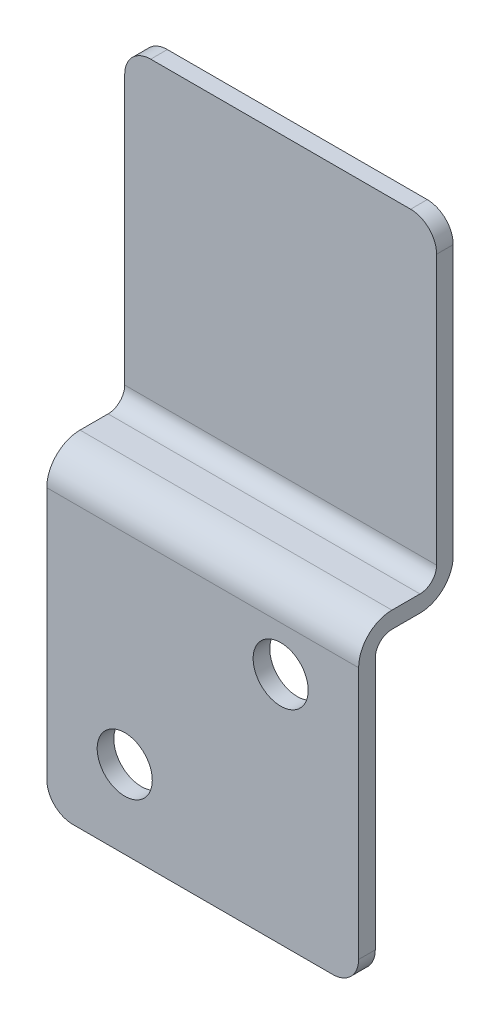
ISO-10303-21;
HEADER;
FILE_DESCRIPTION(('STEP AP214'),'2;1');
FILE_NAME('part.step','',(''),(''),'','','');
FILE_SCHEMA(('AUTOMOTIVE_DESIGN { 1 0 10303 214 1 1 1 1 }'));
ENDSEC;
DATA;
#1=APPLICATION_CONTEXT('core data for automotive mechanical design processes');
#2=APPLICATION_PROTOCOL_DEFINITION('international standard','automotive_design',2000,#1);
#3=PRODUCT_CONTEXT('',#1,'mechanical');
#4=PRODUCT('Part','Part','',(#3));
#5=PRODUCT_RELATED_PRODUCT_CATEGORY('part','',(#4));
#6=PRODUCT_DEFINITION_FORMATION('','',#4);
#7=PRODUCT_DEFINITION_CONTEXT('part definition',#1,'design');
#8=PRODUCT_DEFINITION('design','',#6,#7);
#9=PRODUCT_DEFINITION_SHAPE('','',#8);
#10=(LENGTH_UNIT() NAMED_UNIT(*) SI_UNIT(.MILLI.,.METRE.));
#11=(NAMED_UNIT(*) PLANE_ANGLE_UNIT() SI_UNIT($,.RADIAN.));
#12=(NAMED_UNIT(*) SI_UNIT($,.STERADIAN.) SOLID_ANGLE_UNIT());
#13=UNCERTAINTY_MEASURE_WITH_UNIT(LENGTH_MEASURE(1.E-05),#10,'distance_accuracy_value','');
#14=(GEOMETRIC_REPRESENTATION_CONTEXT(3) GLOBAL_UNCERTAINTY_ASSIGNED_CONTEXT((#13)) GLOBAL_UNIT_ASSIGNED_CONTEXT((#10,
#11,#12)) REPRESENTATION_CONTEXT('',''));
#15=CARTESIAN_POINT('',(0.,0.,0.));
#16=DIRECTION('',(0.,0.,1.));
#17=DIRECTION('',(1.,0.,0.));
#18=AXIS2_PLACEMENT_3D('',#15,#16,#17);
#19=CARTESIAN_POINT('',(38.1,0.,0.));
#20=DIRECTION('',(0.,-1.,0.));
#21=DIRECTION('',(0.,0.,-1.));
#22=AXIS2_PLACEMENT_3D('',#19,#20,#21);
#23=PLANE('',#22);
#24=DIRECTION('',(-1.,0.,0.));
#25=VECTOR('',#24,1.);
#26=CARTESIAN_POINT('',(38.1,0.,-2.032));
#27=LINE('',#26,#25);
#28=CARTESIAN_POINT('',(34.925,0.,-2.032));
#29=VERTEX_POINT('',#28);
#30=CARTESIAN_POINT('',(3.17500000000001,0.,-2.032));
#31=VERTEX_POINT('',#30);
#32=EDGE_CURVE('E189',#29,#31,#27,.T.);
#33=ORIENTED_EDGE('',*,*,#32,.T.);
#34=DIRECTION('',(0.,0.,1.));
#35=VECTOR('',#34,1.);
#36=CARTESIAN_POINT('',(3.175,0.,0.));
#37=LINE('',#36,#35);
#38=CARTESIAN_POINT('',(3.17500000000001,0.,0.));
#39=VERTEX_POINT('',#38);
#40=EDGE_CURVE('E249',#31,#39,#37,.T.);
#41=ORIENTED_EDGE('',*,*,#40,.T.);
#42=DIRECTION('',(-1.,0.,0.));
#43=VECTOR('',#42,1.);
#44=CARTESIAN_POINT('',(38.1,0.,0.));
#45=LINE('',#44,#43);
#46=CARTESIAN_POINT('',(34.925,0.,0.));
#47=VERTEX_POINT('',#46);
#48=EDGE_CURVE('E174',#47,#39,#45,.T.);
#49=ORIENTED_EDGE('',*,*,#48,.F.);
#50=DIRECTION('',(0.,0.,1.));
#51=VECTOR('',#50,1.);
#52=CARTESIAN_POINT('',(34.925,0.,0.));
#53=LINE('',#52,#51);
#54=EDGE_CURVE('E247',#47,#29,#53,.F.);
#55=ORIENTED_EDGE('',*,*,#54,.T.);
#56=EDGE_LOOP('',(#33,#41,#49,#55));
#57=FACE_BOUND('',#56,.T.);
#58=ADVANCED_FACE('F34',(#57),#23,.F.);
#59=CARTESIAN_POINT('',(38.1,0.,0.));
#60=DIRECTION('',(0.,0.,-1.));
#61=DIRECTION('',(0.,1.,0.));
#62=AXIS2_PLACEMENT_3D('',#59,#60,#61);
#63=PLANE('',#62);
#64=ORIENTED_EDGE('',*,*,#48,.T.);
#65=CARTESIAN_POINT('',(3.175,-3.175,0.));
#66=DIRECTION('',(0.,0.,-1.));
#67=DIRECTION('',(0.,1.,0.));
#68=AXIS2_PLACEMENT_3D('',#65,#66,#67);
#69=CIRCLE('',#68,3.175);
#70=CARTESIAN_POINT('',(0.,-3.175,0.));
#71=VERTEX_POINT('',#70);
#72=EDGE_CURVE('E253',#39,#71,#69,.F.);
#73=ORIENTED_EDGE('',*,*,#72,.T.);
#74=DIRECTION('',(0.,-1.,0.));
#75=VECTOR('',#74,1.);
#76=CARTESIAN_POINT('',(0.,0.,0.));
#77=LINE('',#76,#75);
#78=CARTESIAN_POINT('',(0.,-36.068,0.));
#79=VERTEX_POINT('',#78);
#80=EDGE_CURVE('E264',#71,#79,#77,.T.);
#81=ORIENTED_EDGE('',*,*,#80,.T.);
#82=DIRECTION('',(-1.,0.,0.));
#83=VECTOR('',#82,1.);
#84=CARTESIAN_POINT('',(38.1,-36.068,0.));
#85=LINE('',#84,#83);
#86=CARTESIAN_POINT('',(38.1,-36.068,0.));
#87=VERTEX_POINT('',#86);
#88=EDGE_CURVE('E164',#79,#87,#85,.F.);
#89=ORIENTED_EDGE('',*,*,#88,.T.);
#90=DIRECTION('',(0.,-1.,0.));
#91=VECTOR('',#90,1.);
#92=CARTESIAN_POINT('',(38.1,0.,0.));
#93=LINE('',#92,#91);
#94=CARTESIAN_POINT('',(38.1,-3.175,0.));
#95=VERTEX_POINT('',#94);
#96=EDGE_CURVE('E183',#95,#87,#93,.T.);
#97=ORIENTED_EDGE('',*,*,#96,.F.);
#98=CARTESIAN_POINT('',(34.925,-3.175,0.));
#99=DIRECTION('',(0.,0.,-1.));
#100=DIRECTION('',(0.,1.,0.));
#101=AXIS2_PLACEMENT_3D('',#98,#99,#100);
#102=CIRCLE('',#101,3.175);
#103=EDGE_CURVE('E59',#95,#47,#102,.F.);
#104=ORIENTED_EDGE('',*,*,#103,.T.);
#105=EDGE_LOOP('',(#64,#73,#81,#89,#97,#104));
#106=FACE_BOUND('',#105,.T.);
#107=ADVANCED_FACE('F336',(#106),#63,.F.);
#108=CARTESIAN_POINT('',(38.1,-38.1,0.));
#109=DIRECTION('',(0.,-1.,0.));
#110=DIRECTION('',(0.,0.,-1.));
#111=AXIS2_PLACEMENT_3D('',#108,#109,#110);
#112=PLANE('',#111);
#113=DIRECTION('',(0.,0.,1.));
#114=VECTOR('',#113,1.);
#115=CARTESIAN_POINT('',(0.,-38.1,0.));
#116=LINE('',#115,#114);
#117=CARTESIAN_POINT('',(0.,-38.1,2.032));
#118=VERTEX_POINT('',#117);
#119=CARTESIAN_POINT('',(0.,-38.1,5.461));
#120=VERTEX_POINT('',#119);
#121=EDGE_CURVE('E285',#118,#120,#116,.T.);
#122=ORIENTED_EDGE('',*,*,#121,.T.);
#123=DIRECTION('',(-1.,0.,0.));
#124=VECTOR('',#123,1.);
#125=CARTESIAN_POINT('',(38.1,-38.1,5.461));
#126=LINE('',#125,#124);
#127=CARTESIAN_POINT('',(38.1,-38.1,5.461));
#128=VERTEX_POINT('',#127);
#129=EDGE_CURVE('E219',#120,#128,#126,.F.);
#130=ORIENTED_EDGE('',*,*,#129,.T.);
#131=DIRECTION('',(0.,0.,1.));
#132=VECTOR('',#131,1.);
#133=CARTESIAN_POINT('',(38.1,-38.1,0.));
#134=LINE('',#133,#132);
#135=CARTESIAN_POINT('',(38.1,-38.1,2.032));
#136=VERTEX_POINT('',#135);
#137=EDGE_CURVE('E274',#136,#128,#134,.T.);
#138=ORIENTED_EDGE('',*,*,#137,.F.);
#139=DIRECTION('',(-1.,0.,0.));
#140=VECTOR('',#139,1.);
#141=CARTESIAN_POINT('',(0.,-38.1,2.032));
#142=LINE('',#141,#140);
#143=EDGE_CURVE('E202',#136,#118,#142,.T.);
#144=ORIENTED_EDGE('',*,*,#143,.T.);
#145=EDGE_LOOP('',(#122,#130,#138,#144));
#146=FACE_BOUND('',#145,.T.);
#147=ADVANCED_FACE('F318',(#146),#112,.F.);
#148=CARTESIAN_POINT('',(38.1,-38.1,9.525));
#149=DIRECTION('',(0.,0.,-1.));
#150=DIRECTION('',(0.,1.,0.));
#151=AXIS2_PLACEMENT_3D('',#148,#149,#150);
#152=PLANE('',#151);
#153=CARTESIAN_POINT('',(9.525,-66.675,9.52500000000001));
#154=DIRECTION('',(0.,0.,1.));
#155=DIRECTION('',(1.,0.,0.));
#156=AXIS2_PLACEMENT_3D('',#153,#154,#155);
#157=CIRCLE('',#156,3.3655);
#158=CARTESIAN_POINT('',(12.8905,-66.675,9.52500000000001));
#159=VERTEX_POINT('',#158);
#160=EDGE_CURVE('E260',#159,#159,#157,.T.);
#161=ORIENTED_EDGE('',*,*,#160,.F.);
#162=EDGE_LOOP('',(#161));
#163=FACE_BOUND('',#162,.T.);
#164=CARTESIAN_POINT('',(28.575,-47.625,9.52500000000001));
#165=DIRECTION('',(0.,0.,1.));
#166=DIRECTION('',(1.,0.,0.));
#167=AXIS2_PLACEMENT_3D('',#164,#165,#166);
#168=CIRCLE('',#167,3.36549999999999);
#169=CARTESIAN_POINT('',(31.9405,-47.625,9.52500000000001));
#170=VERTEX_POINT('',#169);
#171=EDGE_CURVE('E266',#170,#170,#168,.T.);
#172=ORIENTED_EDGE('',*,*,#171,.F.);
#173=EDGE_LOOP('',(#172));
#174=FACE_BOUND('',#173,.T.);
#175=DIRECTION('',(0.,-1.,0.));
#176=VECTOR('',#175,1.);
#177=CARTESIAN_POINT('',(0.,-38.1,9.525));
#178=LINE('',#177,#176);
#179=CARTESIAN_POINT('',(0.,-42.164,9.525));
#180=VERTEX_POINT('',#179);
#181=CARTESIAN_POINT('',(0.,-73.025,9.52499999999999));
#182=VERTEX_POINT('',#181);
#183=EDGE_CURVE('E185',#180,#182,#178,.T.);
#184=ORIENTED_EDGE('',*,*,#183,.T.);
#185=CARTESIAN_POINT('',(3.175,-73.025,9.52499999999999));
#186=DIRECTION('',(0.,0.,-1.));
#187=DIRECTION('',(0.,1.,0.));
#188=AXIS2_PLACEMENT_3D('',#185,#186,#187);
#189=CIRCLE('',#188,3.175);
#190=CARTESIAN_POINT('',(3.17500000000001,-76.2,9.52499999999999));
#191=VERTEX_POINT('',#190);
#192=EDGE_CURVE('E245',#182,#191,#189,.F.);
#193=ORIENTED_EDGE('',*,*,#192,.T.);
#194=DIRECTION('',(-1.,0.,0.));
#195=VECTOR('',#194,1.);
#196=CARTESIAN_POINT('',(38.1,-76.2,9.52499999999999));
#197=LINE('',#196,#195);
#198=CARTESIAN_POINT('',(34.925,-76.2,9.52499999999999));
#199=VERTEX_POINT('',#198);
#200=EDGE_CURVE('E196',#199,#191,#197,.T.);
#201=ORIENTED_EDGE('',*,*,#200,.F.);
#202=CARTESIAN_POINT('',(34.925,-73.025,9.52499999999999));
#203=DIRECTION('',(0.,0.,-1.));
#204=DIRECTION('',(0.,1.,0.));
#205=AXIS2_PLACEMENT_3D('',#202,#203,#204);
#206=CIRCLE('',#205,3.175);
#207=CARTESIAN_POINT('',(38.1,-73.025,9.52499999999999));
#208=VERTEX_POINT('',#207);
#209=EDGE_CURVE('E243',#199,#208,#206,.F.);
#210=ORIENTED_EDGE('',*,*,#209,.T.);
#211=DIRECTION('',(0.,-1.,0.));
#212=VECTOR('',#211,1.);
#213=CARTESIAN_POINT('',(38.1,-38.1,9.525));
#214=LINE('',#213,#212);
#215=CARTESIAN_POINT('',(38.1,-42.164,9.525));
#216=VERTEX_POINT('',#215);
#217=EDGE_CURVE('E277',#216,#208,#214,.T.);
#218=ORIENTED_EDGE('',*,*,#217,.F.);
#219=DIRECTION('',(-1.,0.,0.));
#220=VECTOR('',#219,1.);
#221=CARTESIAN_POINT('',(38.1,-42.164,9.525));
#222=LINE('',#221,#220);
#223=EDGE_CURVE('E213',#216,#180,#222,.T.);
#224=ORIENTED_EDGE('',*,*,#223,.T.);
#225=EDGE_LOOP('',(#184,#193,#201,#210,#218,#224));
#226=FACE_BOUND('',#225,.T.);
#227=ADVANCED_FACE('F291',(#163,#174,#226),#152,.F.);
#228=CARTESIAN_POINT('',(38.1,-76.2,9.52499999999999));
#229=DIRECTION('',(0.,1.,0.));
#230=DIRECTION('',(0.,0.,1.));
#231=AXIS2_PLACEMENT_3D('',#228,#229,#230);
#232=PLANE('',#231);
#233=ORIENTED_EDGE('',*,*,#200,.T.);
#234=DIRECTION('',(0.,0.,-1.));
#235=VECTOR('',#234,1.);
#236=CARTESIAN_POINT('',(3.175,-76.2,7.49299999999999));
#237=LINE('',#236,#235);
#238=CARTESIAN_POINT('',(3.17500000000001,-76.2,7.49299999999999));
#239=VERTEX_POINT('',#238);
#240=EDGE_CURVE('E232',#191,#239,#237,.T.);
#241=ORIENTED_EDGE('',*,*,#240,.T.);
#242=DIRECTION('',(-1.,0.,0.));
#243=VECTOR('',#242,1.);
#244=CARTESIAN_POINT('',(38.1,-76.2,7.49299999999999));
#245=LINE('',#244,#243);
#246=CARTESIAN_POINT('',(34.925,-76.2,7.49299999999999));
#247=VERTEX_POINT('',#246);
#248=EDGE_CURVE('E192',#247,#239,#245,.T.);
#249=ORIENTED_EDGE('',*,*,#248,.F.);
#250=DIRECTION('',(0.,0.,-1.));
#251=VECTOR('',#250,1.);
#252=CARTESIAN_POINT('',(34.925,-76.2,9.52499999999999));
#253=LINE('',#252,#251);
#254=EDGE_CURVE('E230',#247,#199,#253,.F.);
#255=ORIENTED_EDGE('',*,*,#254,.T.);
#256=EDGE_LOOP('',(#233,#241,#249,#255));
#257=FACE_BOUND('',#256,.T.);
#258=ADVANCED_FACE('F301',(#257),#232,.F.);
#259=CARTESIAN_POINT('',(38.1,-40.132,7.493));
#260=DIRECTION('',(0.,0.,1.));
#261=DIRECTION('',(0.,-1.,0.));
#262=AXIS2_PLACEMENT_3D('',#259,#260,#261);
#263=PLANE('',#262);
#264=CARTESIAN_POINT('',(9.525,-66.675,7.49299999999999));
#265=DIRECTION('',(0.,0.,1.));
#266=DIRECTION('',(0.,-1.,0.));
#267=AXIS2_PLACEMENT_3D('',#264,#265,#266);
#268=CIRCLE('',#267,3.3655);
#269=CARTESIAN_POINT('',(9.525,-70.0405,7.49299999999999));
#270=VERTEX_POINT('',#269);
#271=EDGE_CURVE('E38',#270,#270,#268,.T.);
#272=ORIENTED_EDGE('',*,*,#271,.T.);
#273=EDGE_LOOP('',(#272));
#274=FACE_BOUND('',#273,.T.);
#275=CARTESIAN_POINT('',(28.575,-47.625,7.493));
#276=DIRECTION('',(0.,0.,1.));
#277=DIRECTION('',(0.,-1.,0.));
#278=AXIS2_PLACEMENT_3D('',#275,#276,#277);
#279=CIRCLE('',#278,3.36549999999999);
#280=CARTESIAN_POINT('',(28.575,-50.9905,7.493));
#281=VERTEX_POINT('',#280);
#282=EDGE_CURVE('E258',#281,#281,#279,.T.);
#283=ORIENTED_EDGE('',*,*,#282,.T.);
#284=EDGE_LOOP('',(#283));
#285=FACE_BOUND('',#284,.T.);
#286=ORIENTED_EDGE('',*,*,#248,.T.);
#287=CARTESIAN_POINT('',(3.175,-73.025,7.49299999999999));
#288=DIRECTION('',(0.,0.,1.));
#289=DIRECTION('',(0.,-1.,0.));
#290=AXIS2_PLACEMENT_3D('',#287,#288,#289);
#291=CIRCLE('',#290,3.175);
#292=CARTESIAN_POINT('',(0.,-73.025,7.49299999999999));
#293=VERTEX_POINT('',#292);
#294=EDGE_CURVE('E237',#239,#293,#291,.F.);
#295=ORIENTED_EDGE('',*,*,#294,.T.);
#296=DIRECTION('',(0.,1.,0.));
#297=VECTOR('',#296,1.);
#298=CARTESIAN_POINT('',(0.,-40.132,7.493));
#299=LINE('',#298,#297);
#300=CARTESIAN_POINT('',(0.,-42.164,7.493));
#301=VERTEX_POINT('',#300);
#302=EDGE_CURVE('E180',#293,#301,#299,.T.);
#303=ORIENTED_EDGE('',*,*,#302,.T.);
#304=DIRECTION('',(-1.,0.,0.));
#305=VECTOR('',#304,1.);
#306=CARTESIAN_POINT('',(38.1,-42.164,7.493));
#307=LINE('',#306,#305);
#308=CARTESIAN_POINT('',(38.1,-42.164,7.493));
#309=VERTEX_POINT('',#308);
#310=EDGE_CURVE('E159',#301,#309,#307,.F.);
#311=ORIENTED_EDGE('',*,*,#310,.T.);
#312=DIRECTION('',(0.,1.,0.));
#313=VECTOR('',#312,1.);
#314=CARTESIAN_POINT('',(38.1,-40.132,7.493));
#315=LINE('',#314,#313);
#316=CARTESIAN_POINT('',(38.1,-73.025,7.49299999999999));
#317=VERTEX_POINT('',#316);
#318=EDGE_CURVE('E280',#317,#309,#315,.T.);
#319=ORIENTED_EDGE('',*,*,#318,.F.);
#320=CARTESIAN_POINT('',(34.925,-73.025,7.49299999999999));
#321=DIRECTION('',(0.,0.,1.));
#322=DIRECTION('',(0.,-1.,0.));
#323=AXIS2_PLACEMENT_3D('',#320,#321,#322);
#324=CIRCLE('',#323,3.175);
#325=EDGE_CURVE('E235',#317,#247,#324,.F.);
#326=ORIENTED_EDGE('',*,*,#325,.T.);
#327=EDGE_LOOP('',(#286,#295,#303,#311,#319,#326));
#328=FACE_BOUND('',#327,.T.);
#329=ADVANCED_FACE('F304',(#274,#285,#328),#263,.F.);
#330=CARTESIAN_POINT('',(38.1,-40.132,-2.032));
#331=DIRECTION('',(0.,1.,0.));
#332=DIRECTION('',(0.,0.,1.));
#333=AXIS2_PLACEMENT_3D('',#330,#331,#332);
#334=PLANE('',#333);
#335=DIRECTION('',(0.,0.,-1.));
#336=VECTOR('',#335,1.);
#337=CARTESIAN_POINT('',(0.,-40.132,-2.032));
#338=LINE('',#337,#336);
#339=CARTESIAN_POINT('',(0.,-40.132,5.461));
#340=VERTEX_POINT('',#339);
#341=CARTESIAN_POINT('',(0.,-40.132,2.032));
#342=VERTEX_POINT('',#341);
#343=EDGE_CURVE('E170',#340,#342,#338,.T.);
#344=ORIENTED_EDGE('',*,*,#343,.T.);
#345=DIRECTION('',(-1.,0.,0.));
#346=VECTOR('',#345,1.);
#347=CARTESIAN_POINT('',(38.1,-40.132,2.032));
#348=LINE('',#347,#346);
#349=CARTESIAN_POINT('',(38.1,-40.132,2.032));
#350=VERTEX_POINT('',#349);
#351=EDGE_CURVE('E228',#342,#350,#348,.F.);
#352=ORIENTED_EDGE('',*,*,#351,.T.);
#353=DIRECTION('',(0.,0.,-1.));
#354=VECTOR('',#353,1.);
#355=CARTESIAN_POINT('',(38.1,-40.132,-2.032));
#356=LINE('',#355,#354);
#357=CARTESIAN_POINT('',(38.1,-40.132,5.461));
#358=VERTEX_POINT('',#357);
#359=EDGE_CURVE('E173',#358,#350,#356,.T.);
#360=ORIENTED_EDGE('',*,*,#359,.F.);
#361=DIRECTION('',(-1.,0.,0.));
#362=VECTOR('',#361,1.);
#363=CARTESIAN_POINT('',(0.,-40.132,5.461));
#364=LINE('',#363,#362);
#365=EDGE_CURVE('E157',#358,#340,#364,.T.);
#366=ORIENTED_EDGE('',*,*,#365,.T.);
#367=EDGE_LOOP('',(#344,#352,#360,#366));
#368=FACE_BOUND('',#367,.T.);
#369=ADVANCED_FACE('F169',(#368),#334,.F.);
#370=CARTESIAN_POINT('',(38.1,0.,-2.032));
#371=DIRECTION('',(0.,0.,1.));
#372=DIRECTION('',(0.,-1.,0.));
#373=AXIS2_PLACEMENT_3D('',#370,#371,#372);
#374=PLANE('',#373);
#375=DIRECTION('',(0.,1.,0.));
#376=VECTOR('',#375,1.);
#377=CARTESIAN_POINT('',(0.,0.,-2.032));
#378=LINE('',#377,#376);
#379=CARTESIAN_POINT('',(0.,-36.068,-2.032));
#380=VERTEX_POINT('',#379);
#381=CARTESIAN_POINT('',(0.,-3.175,-2.032));
#382=VERTEX_POINT('',#381);
#383=EDGE_CURVE('E179',#380,#382,#378,.T.);
#384=ORIENTED_EDGE('',*,*,#383,.T.);
#385=CARTESIAN_POINT('',(3.175,-3.175,-2.032));
#386=DIRECTION('',(0.,0.,1.));
#387=DIRECTION('',(0.,-1.,0.));
#388=AXIS2_PLACEMENT_3D('',#385,#386,#387);
#389=CIRCLE('',#388,3.175);
#390=EDGE_CURVE('E256',#382,#31,#389,.F.);
#391=ORIENTED_EDGE('',*,*,#390,.T.);
#392=ORIENTED_EDGE('',*,*,#32,.F.);
#393=CARTESIAN_POINT('',(34.925,-3.175,-2.032));
#394=DIRECTION('',(0.,0.,1.));
#395=DIRECTION('',(0.,-1.,0.));
#396=AXIS2_PLACEMENT_3D('',#393,#394,#395);
#397=CIRCLE('',#396,3.175);
#398=CARTESIAN_POINT('',(38.1,-3.175,-2.032));
#399=VERTEX_POINT('',#398);
#400=EDGE_CURVE('E51',#29,#399,#397,.F.);
#401=ORIENTED_EDGE('',*,*,#400,.T.);
#402=DIRECTION('',(0.,1.,0.));
#403=VECTOR('',#402,1.);
#404=CARTESIAN_POINT('',(38.1,0.,-2.032));
#405=LINE('',#404,#403);
#406=CARTESIAN_POINT('',(38.1,-36.068,-2.032));
#407=VERTEX_POINT('',#406);
#408=EDGE_CURVE('E193',#407,#399,#405,.T.);
#409=ORIENTED_EDGE('',*,*,#408,.F.);
#410=DIRECTION('',(-1.,0.,0.));
#411=VECTOR('',#410,1.);
#412=CARTESIAN_POINT('',(38.1,-36.068,-2.032));
#413=LINE('',#412,#411);
#414=EDGE_CURVE('E225',#407,#380,#413,.T.);
#415=ORIENTED_EDGE('',*,*,#414,.T.);
#416=EDGE_LOOP('',(#384,#391,#392,#401,#409,#415));
#417=FACE_BOUND('',#416,.T.);
#418=ADVANCED_FACE('F332',(#417),#374,.F.);
#419=CARTESIAN_POINT('',(38.1,0.,0.));
#420=DIRECTION('',(-1.,0.,0.));
#421=DIRECTION('',(0.,0.,1.));
#422=AXIS2_PLACEMENT_3D('',#419,#420,#421);
#423=PLANE('',#422);
#424=ORIENTED_EDGE('',*,*,#217,.T.);
#425=DIRECTION('',(0.,0.,-1.));
#426=VECTOR('',#425,1.);
#427=CARTESIAN_POINT('',(38.1,-73.025,0.));
#428=LINE('',#427,#426);
#429=EDGE_CURVE('E11',#208,#317,#428,.T.);
#430=ORIENTED_EDGE('',*,*,#429,.T.);
#431=ORIENTED_EDGE('',*,*,#318,.T.);
#432=CARTESIAN_POINT('',(38.1,-42.164,5.461));
#433=DIRECTION('',(-1.,0.,0.));
#434=DIRECTION('',(0.,0.,1.));
#435=AXIS2_PLACEMENT_3D('',#432,#433,#434);
#436=CIRCLE('',#435,2.032);
#437=EDGE_CURVE('E163',#309,#358,#436,.T.);
#438=ORIENTED_EDGE('',*,*,#437,.T.);
#439=ORIENTED_EDGE('',*,*,#359,.T.);
#440=CARTESIAN_POINT('',(38.1,-36.068,2.03199999999999));
#441=DIRECTION('',(-1.,0.,0.));
#442=DIRECTION('',(0.,0.,1.));
#443=AXIS2_PLACEMENT_3D('',#440,#441,#442);
#444=CIRCLE('',#443,4.064);
#445=EDGE_CURVE('E221',#350,#407,#444,.F.);
#446=ORIENTED_EDGE('',*,*,#445,.T.);
#447=ORIENTED_EDGE('',*,*,#408,.T.);
#448=DIRECTION('',(0.,0.,1.));
#449=VECTOR('',#448,1.);
#450=CARTESIAN_POINT('',(38.1,-3.175,0.));
#451=LINE('',#450,#449);
#452=EDGE_CURVE('E43',#399,#95,#451,.T.);
#453=ORIENTED_EDGE('',*,*,#452,.T.);
#454=ORIENTED_EDGE('',*,*,#96,.T.);
#455=CARTESIAN_POINT('',(38.1,-36.068,2.032));
#456=DIRECTION('',(-1.,0.,0.));
#457=DIRECTION('',(0.,0.,1.));
#458=AXIS2_PLACEMENT_3D('',#455,#456,#457);
#459=CIRCLE('',#458,2.032);
#460=EDGE_CURVE('E211',#87,#136,#459,.T.);
#461=ORIENTED_EDGE('',*,*,#460,.T.);
#462=ORIENTED_EDGE('',*,*,#137,.T.);
#463=CARTESIAN_POINT('',(38.1,-42.164,5.461));
#464=DIRECTION('',(-1.,0.,0.));
#465=DIRECTION('',(0.,0.,1.));
#466=AXIS2_PLACEMENT_3D('',#463,#464,#465);
#467=CIRCLE('',#466,4.064);
#468=EDGE_CURVE('E223',#128,#216,#467,.F.);
#469=ORIENTED_EDGE('',*,*,#468,.T.);
#470=EDGE_LOOP('',(#424,#430,#431,#438,#439,#446,#447,#453,#454,#461,#462,#469));
#471=FACE_BOUND('',#470,.T.);
#472=ADVANCED_FACE('F311',(#471),#423,.F.);
#473=CARTESIAN_POINT('',(0.,0.,0.));
#474=DIRECTION('',(-1.,0.,0.));
#475=DIRECTION('',(0.,0.,1.));
#476=AXIS2_PLACEMENT_3D('',#473,#474,#475);
#477=PLANE('',#476);
#478=ORIENTED_EDGE('',*,*,#302,.F.);
#479=DIRECTION('',(0.,0.,-1.));
#480=VECTOR('',#479,1.);
#481=CARTESIAN_POINT('',(0.,-73.025,9.52499999999999));
#482=LINE('',#481,#480);
#483=EDGE_CURVE('E241',#293,#182,#482,.F.);
#484=ORIENTED_EDGE('',*,*,#483,.T.);
#485=ORIENTED_EDGE('',*,*,#183,.F.);
#486=CARTESIAN_POINT('',(0.,-42.164,5.461));
#487=DIRECTION('',(-1.,0.,0.));
#488=DIRECTION('',(0.,0.,1.));
#489=AXIS2_PLACEMENT_3D('',#486,#487,#488);
#490=CIRCLE('',#489,4.064);
#491=EDGE_CURVE('E217',#180,#120,#490,.T.);
#492=ORIENTED_EDGE('',*,*,#491,.T.);
#493=ORIENTED_EDGE('',*,*,#121,.F.);
#494=CARTESIAN_POINT('',(0.,-36.068,2.032));
#495=DIRECTION('',(-1.,0.,0.));
#496=DIRECTION('',(0.,0.,1.));
#497=AXIS2_PLACEMENT_3D('',#494,#495,#496);
#498=CIRCLE('',#497,2.032);
#499=EDGE_CURVE('E208',#118,#79,#498,.F.);
#500=ORIENTED_EDGE('',*,*,#499,.T.);
#501=ORIENTED_EDGE('',*,*,#80,.F.);
#502=DIRECTION('',(0.,0.,1.));
#503=VECTOR('',#502,1.);
#504=CARTESIAN_POINT('',(0.,-3.175,-2.032));
#505=LINE('',#504,#503);
#506=EDGE_CURVE('E239',#71,#382,#505,.F.);
#507=ORIENTED_EDGE('',*,*,#506,.T.);
#508=ORIENTED_EDGE('',*,*,#383,.F.);
#509=CARTESIAN_POINT('',(0.,-36.068,2.03199999999999));
#510=DIRECTION('',(-1.,0.,0.));
#511=DIRECTION('',(0.,0.,1.));
#512=AXIS2_PLACEMENT_3D('',#509,#510,#511);
#513=CIRCLE('',#512,4.064);
#514=EDGE_CURVE('E178',#380,#342,#513,.T.);
#515=ORIENTED_EDGE('',*,*,#514,.T.);
#516=ORIENTED_EDGE('',*,*,#343,.F.);
#517=CARTESIAN_POINT('',(0.,-42.164,5.461));
#518=DIRECTION('',(-1.,0.,0.));
#519=DIRECTION('',(0.,0.,1.));
#520=AXIS2_PLACEMENT_3D('',#517,#518,#519);
#521=CIRCLE('',#520,2.032);
#522=EDGE_CURVE('E153',#340,#301,#521,.F.);
#523=ORIENTED_EDGE('',*,*,#522,.T.);
#524=EDGE_LOOP('',(#478,#484,#485,#492,#493,#500,#501,#507,#508,#515,#516,#523));
#525=FACE_BOUND('',#524,.T.);
#526=ADVANCED_FACE('F176',(#525),#477,.T.);
#527=CARTESIAN_POINT('',(38.1,-42.164,5.461));
#528=DIRECTION('',(1.,0.,0.));
#529=DIRECTION('',(0.,0.,-1.));
#530=AXIS2_PLACEMENT_3D('',#527,#528,#529);
#531=CYLINDRICAL_SURFACE('',#530,2.032);
#532=ORIENTED_EDGE('',*,*,#437,.F.);
#533=ORIENTED_EDGE('',*,*,#310,.F.);
#534=ORIENTED_EDGE('',*,*,#522,.F.);
#535=ORIENTED_EDGE('',*,*,#365,.F.);
#536=EDGE_LOOP('',(#532,#533,#534,#535));
#537=FACE_BOUND('',#536,.T.);
#538=ADVANCED_FACE('F156',(#537),#531,.F.);
#539=CARTESIAN_POINT('',(38.1,-36.068,2.032));
#540=DIRECTION('',(1.,0.,0.));
#541=DIRECTION('',(0.,0.,-1.));
#542=AXIS2_PLACEMENT_3D('',#539,#540,#541);
#543=CYLINDRICAL_SURFACE('',#542,2.032);
#544=ORIENTED_EDGE('',*,*,#460,.F.);
#545=ORIENTED_EDGE('',*,*,#88,.F.);
#546=ORIENTED_EDGE('',*,*,#499,.F.);
#547=ORIENTED_EDGE('',*,*,#143,.F.);
#548=EDGE_LOOP('',(#544,#545,#546,#547));
#549=FACE_BOUND('',#548,.T.);
#550=ADVANCED_FACE('F323',(#549),#543,.F.);
#551=CARTESIAN_POINT('',(38.1,-42.164,5.461));
#552=DIRECTION('',(-1.,0.,0.));
#553=DIRECTION('',(0.,0.,1.));
#554=AXIS2_PLACEMENT_3D('',#551,#552,#553);
#555=CYLINDRICAL_SURFACE('',#554,4.064);
#556=ORIENTED_EDGE('',*,*,#468,.F.);
#557=ORIENTED_EDGE('',*,*,#129,.F.);
#558=ORIENTED_EDGE('',*,*,#491,.F.);
#559=ORIENTED_EDGE('',*,*,#223,.F.);
#560=EDGE_LOOP('',(#556,#557,#558,#559));
#561=FACE_BOUND('',#560,.T.);
#562=ADVANCED_FACE('F314',(#561),#555,.T.);
#563=CARTESIAN_POINT('',(38.1,-36.068,2.03199999999999));
#564=DIRECTION('',(-1.,0.,0.));
#565=DIRECTION('',(0.,0.,1.));
#566=AXIS2_PLACEMENT_3D('',#563,#564,#565);
#567=CYLINDRICAL_SURFACE('',#566,4.064);
#568=ORIENTED_EDGE('',*,*,#445,.F.);
#569=ORIENTED_EDGE('',*,*,#351,.F.);
#570=ORIENTED_EDGE('',*,*,#514,.F.);
#571=ORIENTED_EDGE('',*,*,#414,.F.);
#572=EDGE_LOOP('',(#568,#569,#570,#571));
#573=FACE_BOUND('',#572,.T.);
#574=ADVANCED_FACE('F353',(#573),#567,.T.);
#575=CARTESIAN_POINT('',(3.175,-73.025,9.52499999999999));
#576=DIRECTION('',(0.,0.,1.));
#577=DIRECTION('',(1.,0.,0.));
#578=AXIS2_PLACEMENT_3D('',#575,#576,#577);
#579=CYLINDRICAL_SURFACE('',#578,3.175);
#580=ORIENTED_EDGE('',*,*,#192,.F.);
#581=ORIENTED_EDGE('',*,*,#483,.F.);
#582=ORIENTED_EDGE('',*,*,#294,.F.);
#583=ORIENTED_EDGE('',*,*,#240,.F.);
#584=EDGE_LOOP('',(#580,#581,#582,#583));
#585=FACE_BOUND('',#584,.T.);
#586=ADVANCED_FACE('F298',(#585),#579,.T.);
#587=CARTESIAN_POINT('',(3.175,-3.175,0.));
#588=DIRECTION('',(0.,0.,-1.));
#589=DIRECTION('',(-1.,0.,0.));
#590=AXIS2_PLACEMENT_3D('',#587,#588,#589);
#591=CYLINDRICAL_SURFACE('',#590,3.175);
#592=ORIENTED_EDGE('',*,*,#390,.F.);
#593=ORIENTED_EDGE('',*,*,#506,.F.);
#594=ORIENTED_EDGE('',*,*,#72,.F.);
#595=ORIENTED_EDGE('',*,*,#40,.F.);
#596=EDGE_LOOP('',(#592,#593,#594,#595));
#597=FACE_BOUND('',#596,.T.);
#598=ADVANCED_FACE('F330',(#597),#591,.T.);
#599=CARTESIAN_POINT('',(34.925,-73.025,0.));
#600=DIRECTION('',(0.,0.,-1.));
#601=DIRECTION('',(-1.,0.,0.));
#602=AXIS2_PLACEMENT_3D('',#599,#600,#601);
#603=CYLINDRICAL_SURFACE('',#602,3.175);
#604=ORIENTED_EDGE('',*,*,#209,.F.);
#605=ORIENTED_EDGE('',*,*,#254,.F.);
#606=ORIENTED_EDGE('',*,*,#325,.F.);
#607=ORIENTED_EDGE('',*,*,#429,.F.);
#608=EDGE_LOOP('',(#604,#605,#606,#607));
#609=FACE_BOUND('',#608,.T.);
#610=ADVANCED_FACE('F309',(#609),#603,.T.);
#611=CARTESIAN_POINT('',(34.925,-3.175,0.));
#612=DIRECTION('',(0.,0.,1.));
#613=DIRECTION('',(1.,0.,0.));
#614=AXIS2_PLACEMENT_3D('',#611,#612,#613);
#615=CYLINDRICAL_SURFACE('',#614,3.175);
#616=ORIENTED_EDGE('',*,*,#400,.F.);
#617=ORIENTED_EDGE('',*,*,#54,.F.);
#618=ORIENTED_EDGE('',*,*,#103,.F.);
#619=ORIENTED_EDGE('',*,*,#452,.F.);
#620=EDGE_LOOP('',(#616,#617,#618,#619));
#621=FACE_BOUND('',#620,.T.);
#622=ADVANCED_FACE('F36',(#621),#615,.T.);
#623=CARTESIAN_POINT('',(28.575,-47.625,-2.03200000000001));
#624=DIRECTION('',(0.,0.,1.));
#625=DIRECTION('',(1.,0.,0.));
#626=AXIS2_PLACEMENT_3D('',#623,#624,#625);
#627=CYLINDRICAL_SURFACE('',#626,3.36549999999999);
#628=ORIENTED_EDGE('',*,*,#171,.T.);
#629=EDGE_LOOP('',(#628));
#630=FACE_BOUND('',#629,.T.);
#631=ORIENTED_EDGE('',*,*,#282,.F.);
#632=EDGE_LOOP('',(#631));
#633=FACE_BOUND('',#632,.T.);
#634=ADVANCED_FACE('F364',(#630,#633),#627,.F.);
#635=CARTESIAN_POINT('',(9.525,-66.675,-2.03200000000001));
#636=DIRECTION('',(0.,0.,1.));
#637=DIRECTION('',(1.,0.,0.));
#638=AXIS2_PLACEMENT_3D('',#635,#636,#637);
#639=CYLINDRICAL_SURFACE('',#638,3.3655);
#640=ORIENTED_EDGE('',*,*,#160,.T.);
#641=EDGE_LOOP('',(#640));
#642=FACE_BOUND('',#641,.T.);
#643=ORIENTED_EDGE('',*,*,#271,.F.);
#644=EDGE_LOOP('',(#643));
#645=FACE_BOUND('',#644,.T.);
#646=ADVANCED_FACE('F368',(#642,#645),#639,.F.);
#647=CLOSED_SHELL('',(#58,#107,#147,#227,#258,#329,#369,#418,#472,#526,#538,#550,#562,#574,#586,
#598,#610,#622,#634,#646));
#648=MANIFOLD_SOLID_BREP('B2',#647);
#649=ADVANCED_BREP_SHAPE_REPRESENTATION('',(#18,#648),#14);
#650=SHAPE_DEFINITION_REPRESENTATION(#9,#649);
ENDSEC;
END-ISO-10303-21;
